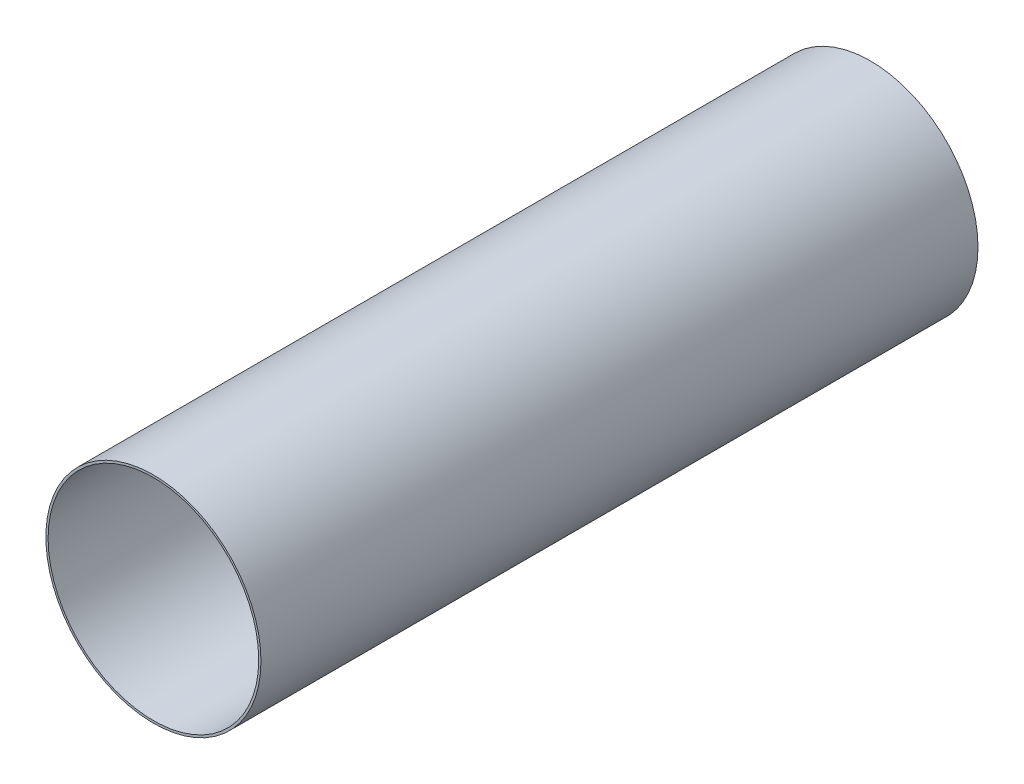
ISO-10303-21;
HEADER;
FILE_DESCRIPTION(('STEP AP214'),'2;1');
FILE_NAME('part.step','',(''),(''),'','','');
FILE_SCHEMA(('AUTOMOTIVE_DESIGN { 1 0 10303 214 1 1 1 1 }'));
ENDSEC;
DATA;
#1=APPLICATION_CONTEXT('core data for automotive mechanical design processes');
#2=APPLICATION_PROTOCOL_DEFINITION('international standard','automotive_design',2000,#1);
#3=PRODUCT_CONTEXT('',#1,'mechanical');
#4=PRODUCT('Part','Part','',(#3));
#5=PRODUCT_RELATED_PRODUCT_CATEGORY('part','',(#4));
#6=PRODUCT_DEFINITION_FORMATION('','',#4);
#7=PRODUCT_DEFINITION_CONTEXT('part definition',#1,'design');
#8=PRODUCT_DEFINITION('design','',#6,#7);
#9=PRODUCT_DEFINITION_SHAPE('','',#8);
#10=(LENGTH_UNIT() NAMED_UNIT(*) SI_UNIT(.MILLI.,.METRE.));
#11=(NAMED_UNIT(*) PLANE_ANGLE_UNIT() SI_UNIT($,.RADIAN.));
#12=(NAMED_UNIT(*) SI_UNIT($,.STERADIAN.) SOLID_ANGLE_UNIT());
#13=UNCERTAINTY_MEASURE_WITH_UNIT(LENGTH_MEASURE(1.E-05),#10,'distance_accuracy_value','');
#14=(GEOMETRIC_REPRESENTATION_CONTEXT(3) GLOBAL_UNCERTAINTY_ASSIGNED_CONTEXT((#13)) GLOBAL_UNIT_ASSIGNED_CONTEXT((#10,
#11,#12)) REPRESENTATION_CONTEXT('',''));
#15=CARTESIAN_POINT('',(0.,0.,0.));
#16=DIRECTION('',(0.,0.,1.));
#17=DIRECTION('',(1.,0.,0.));
#18=AXIS2_PLACEMENT_3D('',#15,#16,#17);
#19=CARTESIAN_POINT('',(0.,0.,1016.));
#20=DIRECTION('',(0.,0.,-1.));
#21=DIRECTION('',(-1.,0.,0.));
#22=AXIS2_PLACEMENT_3D('',#19,#20,#21);
#23=CYLINDRICAL_SURFACE('',#22,152.4);
#24=CARTESIAN_POINT('',(0.,0.,1016.));
#25=DIRECTION('',(0.,0.,1.));
#26=DIRECTION('',(1.,0.,0.));
#27=AXIS2_PLACEMENT_3D('',#24,#25,#26);
#28=CIRCLE('',#27,152.4);
#29=CARTESIAN_POINT('',(152.4,0.,1016.));
#30=VERTEX_POINT('',#29);
#31=EDGE_CURVE('E10',#30,#30,#28,.T.);
#32=ORIENTED_EDGE('',*,*,#31,.F.);
#33=EDGE_LOOP('',(#32));
#34=FACE_BOUND('',#33,.T.);
#35=CARTESIAN_POINT('',(0.,0.,0.));
#36=DIRECTION('',(0.,0.,1.));
#37=DIRECTION('',(1.,0.,0.));
#38=AXIS2_PLACEMENT_3D('',#35,#36,#37);
#39=CIRCLE('',#38,152.4);
#40=CARTESIAN_POINT('',(152.4,0.,0.));
#41=VERTEX_POINT('',#40);
#42=EDGE_CURVE('E40',#41,#41,#39,.T.);
#43=ORIENTED_EDGE('',*,*,#42,.T.);
#44=EDGE_LOOP('',(#43));
#45=FACE_BOUND('',#44,.T.);
#46=ADVANCED_FACE('F37',(#34,#45),#23,.T.);
#47=CARTESIAN_POINT('',(0.,0.,1016.));
#48=DIRECTION('',(0.,0.,1.));
#49=DIRECTION('',(1.,0.,0.));
#50=AXIS2_PLACEMENT_3D('',#47,#48,#49);
#51=PLANE('',#50);
#52=CARTESIAN_POINT('',(0.,0.,1016.));
#53=DIRECTION('',(0.,0.,1.));
#54=DIRECTION('',(1.,0.,0.));
#55=AXIS2_PLACEMENT_3D('',#52,#53,#54);
#56=CIRCLE('',#55,149.225);
#57=CARTESIAN_POINT('',(149.225,0.,1016.));
#58=VERTEX_POINT('',#57);
#59=EDGE_CURVE('E51',#58,#58,#56,.T.);
#60=ORIENTED_EDGE('',*,*,#59,.F.);
#61=EDGE_LOOP('',(#60));
#62=FACE_BOUND('',#61,.T.);
#63=ORIENTED_EDGE('',*,*,#31,.T.);
#64=EDGE_LOOP('',(#63));
#65=FACE_BOUND('',#64,.T.);
#66=ADVANCED_FACE('F68',(#62,#65),#51,.T.);
#67=CARTESIAN_POINT('',(0.,0.,0.));
#68=DIRECTION('',(0.,0.,1.));
#69=DIRECTION('',(1.,0.,0.));
#70=AXIS2_PLACEMENT_3D('',#67,#68,#69);
#71=PLANE('',#70);
#72=CARTESIAN_POINT('',(0.,0.,0.));
#73=DIRECTION('',(0.,0.,1.));
#74=DIRECTION('',(1.,0.,0.));
#75=AXIS2_PLACEMENT_3D('',#72,#73,#74);
#76=CIRCLE('',#75,149.225);
#77=CARTESIAN_POINT('',(149.225,0.,0.));
#78=VERTEX_POINT('',#77);
#79=EDGE_CURVE('E49',#78,#78,#76,.T.);
#80=ORIENTED_EDGE('',*,*,#79,.T.);
#81=EDGE_LOOP('',(#80));
#82=FACE_BOUND('',#81,.T.);
#83=ORIENTED_EDGE('',*,*,#42,.F.);
#84=EDGE_LOOP('',(#83));
#85=FACE_BOUND('',#84,.T.);
#86=ADVANCED_FACE('F59',(#82,#85),#71,.F.);
#87=CARTESIAN_POINT('',(0.,0.,0.));
#88=DIRECTION('',(0.,0.,1.));
#89=DIRECTION('',(1.,0.,0.));
#90=AXIS2_PLACEMENT_3D('',#87,#88,#89);
#91=CYLINDRICAL_SURFACE('',#90,149.225);
#92=ORIENTED_EDGE('',*,*,#79,.F.);
#93=EDGE_LOOP('',(#92));
#94=FACE_BOUND('',#93,.T.);
#95=ORIENTED_EDGE('',*,*,#59,.T.);
#96=EDGE_LOOP('',(#95));
#97=FACE_BOUND('',#96,.T.);
#98=ADVANCED_FACE('F62',(#94,#97),#91,.F.);
#99=CLOSED_SHELL('',(#46,#66,#86,#98));
#100=MANIFOLD_SOLID_BREP('B2',#99);
#101=ADVANCED_BREP_SHAPE_REPRESENTATION('',(#18,#100),#14);
#102=SHAPE_DEFINITION_REPRESENTATION(#9,#101);
ENDSEC;
END-ISO-10303-21;
